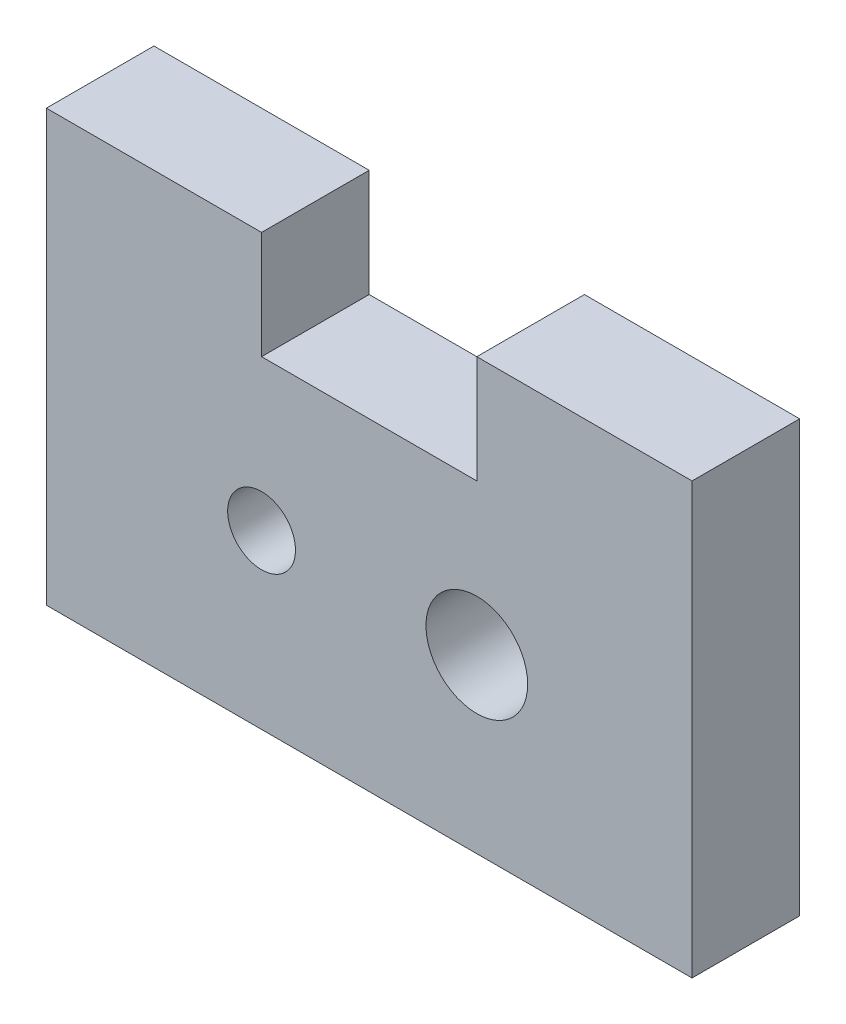
ISO-10303-21;
HEADER;
FILE_DESCRIPTION(('STEP AP214'),'2;1');
FILE_NAME('part.step','',(''),(''),'','','');
FILE_SCHEMA(('AUTOMOTIVE_DESIGN { 1 0 10303 214 1 1 1 1 }'));
ENDSEC;
DATA;
#1=APPLICATION_CONTEXT('core data for automotive mechanical design processes');
#2=APPLICATION_PROTOCOL_DEFINITION('international standard','automotive_design',2000,#1);
#3=PRODUCT_CONTEXT('',#1,'mechanical');
#4=PRODUCT('Part','Part','',(#3));
#5=PRODUCT_RELATED_PRODUCT_CATEGORY('part','',(#4));
#6=PRODUCT_DEFINITION_FORMATION('','',#4);
#7=PRODUCT_DEFINITION_CONTEXT('part definition',#1,'design');
#8=PRODUCT_DEFINITION('design','',#6,#7);
#9=PRODUCT_DEFINITION_SHAPE('','',#8);
#10=(LENGTH_UNIT() NAMED_UNIT(*) SI_UNIT(.MILLI.,.METRE.));
#11=(NAMED_UNIT(*) PLANE_ANGLE_UNIT() SI_UNIT($,.RADIAN.));
#12=(NAMED_UNIT(*) SI_UNIT($,.STERADIAN.) SOLID_ANGLE_UNIT());
#13=UNCERTAINTY_MEASURE_WITH_UNIT(LENGTH_MEASURE(1.E-05),#10,'distance_accuracy_value','');
#14=(GEOMETRIC_REPRESENTATION_CONTEXT(3) GLOBAL_UNCERTAINTY_ASSIGNED_CONTEXT((#13)) GLOBAL_UNIT_ASSIGNED_CONTEXT((#10,
#11,#12)) REPRESENTATION_CONTEXT('',''));
#15=CARTESIAN_POINT('',(0.,0.,0.));
#16=DIRECTION('',(0.,0.,1.));
#17=DIRECTION('',(1.,0.,0.));
#18=AXIS2_PLACEMENT_3D('',#15,#16,#17);
#19=CARTESIAN_POINT('',(0.,0.,3.175));
#20=DIRECTION('',(0.,0.,-1.));
#21=DIRECTION('',(-1.,0.,0.));
#22=AXIS2_PLACEMENT_3D('',#19,#20,#21);
#23=PLANE('',#22);
#24=CARTESIAN_POINT('',(12.7,5.08,3.175));
#25=DIRECTION('',(0.,0.,1.));
#26=DIRECTION('',(1.,0.,0.));
#27=AXIS2_PLACEMENT_3D('',#24,#25,#26);
#28=CIRCLE('',#27,1.5);
#29=CARTESIAN_POINT('',(14.2,5.08,3.175));
#30=VERTEX_POINT('',#29);
#31=EDGE_CURVE('E134',#30,#30,#28,.T.);
#32=ORIENTED_EDGE('',*,*,#31,.F.);
#33=EDGE_LOOP('',(#32));
#34=FACE_BOUND('',#33,.T.);
#35=DIRECTION('',(0.,-1.,0.));
#36=VECTOR('',#35,1.);
#37=CARTESIAN_POINT('',(0.,0.,3.175));
#38=LINE('',#37,#36);
#39=CARTESIAN_POINT('',(0.,12.7,3.175));
#40=VERTEX_POINT('',#39);
#41=CARTESIAN_POINT('',(0.,0.,3.175));
#42=VERTEX_POINT('',#41);
#43=EDGE_CURVE('E145',#40,#42,#38,.T.);
#44=ORIENTED_EDGE('',*,*,#43,.T.);
#45=DIRECTION('',(1.,0.,0.));
#46=VECTOR('',#45,1.);
#47=CARTESIAN_POINT('',(0.,0.,3.175));
#48=LINE('',#47,#46);
#49=CARTESIAN_POINT('',(19.05,0.,3.175));
#50=VERTEX_POINT('',#49);
#51=EDGE_CURVE('E93',#42,#50,#48,.T.);
#52=ORIENTED_EDGE('',*,*,#51,.T.);
#53=DIRECTION('',(0.,1.,0.));
#54=VECTOR('',#53,1.);
#55=CARTESIAN_POINT('',(19.05,0.,3.175));
#56=LINE('',#55,#54);
#57=CARTESIAN_POINT('',(19.05,12.7,3.175));
#58=VERTEX_POINT('',#57);
#59=EDGE_CURVE('E160',#50,#58,#56,.T.);
#60=ORIENTED_EDGE('',*,*,#59,.T.);
#61=DIRECTION('',(-1.,0.,0.));
#62=VECTOR('',#61,1.);
#63=CARTESIAN_POINT('',(12.7,12.7,3.175));
#64=LINE('',#63,#62);
#65=CARTESIAN_POINT('',(12.7,12.7,3.175));
#66=VERTEX_POINT('',#65);
#67=EDGE_CURVE('E173',#58,#66,#64,.T.);
#68=ORIENTED_EDGE('',*,*,#67,.T.);
#69=DIRECTION('',(0.,-1.,0.));
#70=VECTOR('',#69,1.);
#71=CARTESIAN_POINT('',(12.7,9.52500000000001,3.175));
#72=LINE('',#71,#70);
#73=CARTESIAN_POINT('',(12.7,9.52500000000001,3.175));
#74=VERTEX_POINT('',#73);
#75=EDGE_CURVE('E112',#66,#74,#72,.T.);
#76=ORIENTED_EDGE('',*,*,#75,.T.);
#77=DIRECTION('',(-1.,0.,0.));
#78=VECTOR('',#77,1.);
#79=CARTESIAN_POINT('',(6.35,9.52500000000001,3.175));
#80=LINE('',#79,#78);
#81=CARTESIAN_POINT('',(6.35,9.52500000000001,3.175));
#82=VERTEX_POINT('',#81);
#83=EDGE_CURVE('E106',#74,#82,#80,.T.);
#84=ORIENTED_EDGE('',*,*,#83,.T.);
#85=DIRECTION('',(0.,1.,0.));
#86=VECTOR('',#85,1.);
#87=CARTESIAN_POINT('',(6.35,12.7,3.175));
#88=LINE('',#87,#86);
#89=CARTESIAN_POINT('',(6.35,12.7,3.175));
#90=VERTEX_POINT('',#89);
#91=EDGE_CURVE('E110',#82,#90,#88,.T.);
#92=ORIENTED_EDGE('',*,*,#91,.T.);
#93=DIRECTION('',(-1.,0.,0.));
#94=VECTOR('',#93,1.);
#95=CARTESIAN_POINT('',(0.,12.7,3.175));
#96=LINE('',#95,#94);
#97=EDGE_CURVE('E50',#90,#40,#96,.T.);
#98=ORIENTED_EDGE('',*,*,#97,.T.);
#99=EDGE_LOOP('',(#44,#52,#60,#68,#76,#84,#92,#98));
#100=FACE_BOUND('',#99,.T.);
#101=CARTESIAN_POINT('',(6.35,5.08,3.175));
#102=DIRECTION('',(0.,0.,1.));
#103=DIRECTION('',(1.,0.,0.));
#104=AXIS2_PLACEMENT_3D('',#101,#102,#103);
#105=CIRCLE('',#104,1.);
#106=CARTESIAN_POINT('',(7.35,5.08,3.175));
#107=VERTEX_POINT('',#106);
#108=EDGE_CURVE('E182',#107,#107,#105,.T.);
#109=ORIENTED_EDGE('',*,*,#108,.F.);
#110=EDGE_LOOP('',(#109));
#111=FACE_BOUND('',#110,.T.);
#112=ADVANCED_FACE('F33',(#34,#100,#111),#23,.F.);
#113=CARTESIAN_POINT('',(0.,0.,0.));
#114=DIRECTION('',(0.,0.,-1.));
#115=DIRECTION('',(-1.,0.,0.));
#116=AXIS2_PLACEMENT_3D('',#113,#114,#115);
#117=PLANE('',#116);
#118=CARTESIAN_POINT('',(12.7,5.08,0.));
#119=DIRECTION('',(0.,0.,1.));
#120=DIRECTION('',(1.,0.,0.));
#121=AXIS2_PLACEMENT_3D('',#118,#119,#120);
#122=CIRCLE('',#121,1.5);
#123=CARTESIAN_POINT('',(14.2,5.08,0.));
#124=VERTEX_POINT('',#123);
#125=EDGE_CURVE('E179',#124,#124,#122,.T.);
#126=ORIENTED_EDGE('',*,*,#125,.T.);
#127=EDGE_LOOP('',(#126));
#128=FACE_BOUND('',#127,.T.);
#129=DIRECTION('',(0.,-1.,0.));
#130=VECTOR('',#129,1.);
#131=CARTESIAN_POINT('',(0.,0.,0.));
#132=LINE('',#131,#130);
#133=CARTESIAN_POINT('',(0.,12.7,0.));
#134=VERTEX_POINT('',#133);
#135=CARTESIAN_POINT('',(0.,0.,0.));
#136=VERTEX_POINT('',#135);
#137=EDGE_CURVE('E130',#134,#136,#132,.T.);
#138=ORIENTED_EDGE('',*,*,#137,.F.);
#139=DIRECTION('',(-1.,0.,0.));
#140=VECTOR('',#139,1.);
#141=CARTESIAN_POINT('',(0.,12.7,0.));
#142=LINE('',#141,#140);
#143=CARTESIAN_POINT('',(6.35,12.7,0.));
#144=VERTEX_POINT('',#143);
#145=EDGE_CURVE('E85',#144,#134,#142,.T.);
#146=ORIENTED_EDGE('',*,*,#145,.F.);
#147=DIRECTION('',(0.,1.,0.));
#148=VECTOR('',#147,1.);
#149=CARTESIAN_POINT('',(6.35,12.7,0.));
#150=LINE('',#149,#148);
#151=CARTESIAN_POINT('',(6.35,9.52500000000001,0.));
#152=VERTEX_POINT('',#151);
#153=EDGE_CURVE('E79',#152,#144,#150,.T.);
#154=ORIENTED_EDGE('',*,*,#153,.F.);
#155=DIRECTION('',(-1.,0.,0.));
#156=VECTOR('',#155,1.);
#157=CARTESIAN_POINT('',(6.35,9.52500000000001,0.));
#158=LINE('',#157,#156);
#159=CARTESIAN_POINT('',(12.7,9.52500000000001,0.));
#160=VERTEX_POINT('',#159);
#161=EDGE_CURVE('E120',#160,#152,#158,.T.);
#162=ORIENTED_EDGE('',*,*,#161,.F.);
#163=DIRECTION('',(0.,-1.,0.));
#164=VECTOR('',#163,1.);
#165=CARTESIAN_POINT('',(12.7,9.52500000000001,0.));
#166=LINE('',#165,#164);
#167=CARTESIAN_POINT('',(12.7,12.7,0.));
#168=VERTEX_POINT('',#167);
#169=EDGE_CURVE('E140',#168,#160,#166,.T.);
#170=ORIENTED_EDGE('',*,*,#169,.F.);
#171=DIRECTION('',(-1.,0.,0.));
#172=VECTOR('',#171,1.);
#173=CARTESIAN_POINT('',(12.7,12.7,0.));
#174=LINE('',#173,#172);
#175=CARTESIAN_POINT('',(19.05,12.7,0.));
#176=VERTEX_POINT('',#175);
#177=EDGE_CURVE('E138',#176,#168,#174,.T.);
#178=ORIENTED_EDGE('',*,*,#177,.F.);
#179=DIRECTION('',(0.,1.,0.));
#180=VECTOR('',#179,1.);
#181=CARTESIAN_POINT('',(19.05,0.,0.));
#182=LINE('',#181,#180);
#183=CARTESIAN_POINT('',(19.05,0.,0.));
#184=VERTEX_POINT('',#183);
#185=EDGE_CURVE('E136',#184,#176,#182,.T.);
#186=ORIENTED_EDGE('',*,*,#185,.F.);
#187=DIRECTION('',(1.,0.,0.));
#188=VECTOR('',#187,1.);
#189=CARTESIAN_POINT('',(0.,0.,0.));
#190=LINE('',#189,#188);
#191=EDGE_CURVE('E133',#136,#184,#190,.T.);
#192=ORIENTED_EDGE('',*,*,#191,.F.);
#193=EDGE_LOOP('',(#138,#146,#154,#162,#170,#178,#186,#192));
#194=FACE_BOUND('',#193,.T.);
#195=CARTESIAN_POINT('',(6.35,5.08,0.));
#196=DIRECTION('',(0.,0.,1.));
#197=DIRECTION('',(1.,0.,0.));
#198=AXIS2_PLACEMENT_3D('',#195,#196,#197);
#199=CIRCLE('',#198,1.);
#200=CARTESIAN_POINT('',(7.35,5.08,0.));
#201=VERTEX_POINT('',#200);
#202=EDGE_CURVE('E185',#201,#201,#199,.T.);
#203=ORIENTED_EDGE('',*,*,#202,.T.);
#204=EDGE_LOOP('',(#203));
#205=FACE_BOUND('',#204,.T.);
#206=ADVANCED_FACE('F164',(#128,#194,#205),#117,.T.);
#207=CARTESIAN_POINT('',(0.,0.,3.175));
#208=DIRECTION('',(1.,0.,0.));
#209=DIRECTION('',(0.,1.,0.));
#210=AXIS2_PLACEMENT_3D('',#207,#208,#209);
#211=PLANE('',#210);
#212=ORIENTED_EDGE('',*,*,#137,.T.);
#213=DIRECTION('',(0.,0.,-1.));
#214=VECTOR('',#213,1.);
#215=CARTESIAN_POINT('',(0.,0.,3.175));
#216=LINE('',#215,#214);
#217=EDGE_CURVE('E11',#42,#136,#216,.T.);
#218=ORIENTED_EDGE('',*,*,#217,.F.);
#219=ORIENTED_EDGE('',*,*,#43,.F.);
#220=DIRECTION('',(0.,0.,-1.));
#221=VECTOR('',#220,1.);
#222=CARTESIAN_POINT('',(0.,12.7,3.175));
#223=LINE('',#222,#221);
#224=EDGE_CURVE('E126',#40,#134,#223,.T.);
#225=ORIENTED_EDGE('',*,*,#224,.T.);
#226=EDGE_LOOP('',(#212,#218,#219,#225));
#227=FACE_BOUND('',#226,.T.);
#228=ADVANCED_FACE('F35',(#227),#211,.F.);
#229=CARTESIAN_POINT('',(0.,0.,3.175));
#230=DIRECTION('',(0.,1.,0.));
#231=DIRECTION('',(0.,0.,1.));
#232=AXIS2_PLACEMENT_3D('',#229,#230,#231);
#233=PLANE('',#232);
#234=ORIENTED_EDGE('',*,*,#191,.T.);
#235=DIRECTION('',(0.,0.,-1.));
#236=VECTOR('',#235,1.);
#237=CARTESIAN_POINT('',(19.05,0.,3.175));
#238=LINE('',#237,#236);
#239=EDGE_CURVE('E42',#50,#184,#238,.T.);
#240=ORIENTED_EDGE('',*,*,#239,.F.);
#241=ORIENTED_EDGE('',*,*,#51,.F.);
#242=ORIENTED_EDGE('',*,*,#217,.T.);
#243=EDGE_LOOP('',(#234,#240,#241,#242));
#244=FACE_BOUND('',#243,.T.);
#245=ADVANCED_FACE('F218',(#244),#233,.F.);
#246=CARTESIAN_POINT('',(19.05,0.,3.175));
#247=DIRECTION('',(-1.,0.,0.));
#248=DIRECTION('',(0.,0.,1.));
#249=AXIS2_PLACEMENT_3D('',#246,#247,#248);
#250=PLANE('',#249);
#251=ORIENTED_EDGE('',*,*,#185,.T.);
#252=DIRECTION('',(0.,0.,-1.));
#253=VECTOR('',#252,1.);
#254=CARTESIAN_POINT('',(19.05,12.7,3.175));
#255=LINE('',#254,#253);
#256=EDGE_CURVE('E152',#58,#176,#255,.T.);
#257=ORIENTED_EDGE('',*,*,#256,.F.);
#258=ORIENTED_EDGE('',*,*,#59,.F.);
#259=ORIENTED_EDGE('',*,*,#239,.T.);
#260=EDGE_LOOP('',(#251,#257,#258,#259));
#261=FACE_BOUND('',#260,.T.);
#262=ADVANCED_FACE('F158',(#261),#250,.F.);
#263=CARTESIAN_POINT('',(12.7,12.7,3.175));
#264=DIRECTION('',(0.,-1.,0.));
#265=DIRECTION('',(0.,0.,-1.));
#266=AXIS2_PLACEMENT_3D('',#263,#264,#265);
#267=PLANE('',#266);
#268=ORIENTED_EDGE('',*,*,#177,.T.);
#269=DIRECTION('',(0.,0.,-1.));
#270=VECTOR('',#269,1.);
#271=CARTESIAN_POINT('',(12.7,12.7,3.175));
#272=LINE('',#271,#270);
#273=EDGE_CURVE('E149',#66,#168,#272,.T.);
#274=ORIENTED_EDGE('',*,*,#273,.F.);
#275=ORIENTED_EDGE('',*,*,#67,.F.);
#276=ORIENTED_EDGE('',*,*,#256,.T.);
#277=EDGE_LOOP('',(#268,#274,#275,#276));
#278=FACE_BOUND('',#277,.T.);
#279=ADVANCED_FACE('F169',(#278),#267,.F.);
#280=CARTESIAN_POINT('',(12.7,9.52500000000001,3.175));
#281=DIRECTION('',(1.,0.,0.));
#282=DIRECTION('',(0.,1.,0.));
#283=AXIS2_PLACEMENT_3D('',#280,#281,#282);
#284=PLANE('',#283);
#285=ORIENTED_EDGE('',*,*,#169,.T.);
#286=DIRECTION('',(0.,0.,-1.));
#287=VECTOR('',#286,1.);
#288=CARTESIAN_POINT('',(12.7,9.52500000000001,3.175));
#289=LINE('',#288,#287);
#290=EDGE_CURVE('E121',#74,#160,#289,.T.);
#291=ORIENTED_EDGE('',*,*,#290,.F.);
#292=ORIENTED_EDGE('',*,*,#75,.F.);
#293=ORIENTED_EDGE('',*,*,#273,.T.);
#294=EDGE_LOOP('',(#285,#291,#292,#293));
#295=FACE_BOUND('',#294,.T.);
#296=ADVANCED_FACE('F172',(#295),#284,.F.);
#297=CARTESIAN_POINT('',(6.35,9.52500000000001,3.175));
#298=DIRECTION('',(0.,-1.,0.));
#299=DIRECTION('',(0.,0.,-1.));
#300=AXIS2_PLACEMENT_3D('',#297,#298,#299);
#301=PLANE('',#300);
#302=ORIENTED_EDGE('',*,*,#161,.T.);
#303=DIRECTION('',(0.,0.,-1.));
#304=VECTOR('',#303,1.);
#305=CARTESIAN_POINT('',(6.35,9.52500000000001,3.175));
#306=LINE('',#305,#304);
#307=EDGE_CURVE('E117',#82,#152,#306,.T.);
#308=ORIENTED_EDGE('',*,*,#307,.F.);
#309=ORIENTED_EDGE('',*,*,#83,.F.);
#310=ORIENTED_EDGE('',*,*,#290,.T.);
#311=EDGE_LOOP('',(#302,#308,#309,#310));
#312=FACE_BOUND('',#311,.T.);
#313=ADVANCED_FACE('F118',(#312),#301,.F.);
#314=CARTESIAN_POINT('',(6.35,12.7,3.175));
#315=DIRECTION('',(-1.,0.,0.));
#316=DIRECTION('',(0.,-1.,0.));
#317=AXIS2_PLACEMENT_3D('',#314,#315,#316);
#318=PLANE('',#317);
#319=ORIENTED_EDGE('',*,*,#153,.T.);
#320=DIRECTION('',(0.,0.,-1.));
#321=VECTOR('',#320,1.);
#322=CARTESIAN_POINT('',(6.35,12.7,3.175));
#323=LINE('',#322,#321);
#324=EDGE_CURVE('E122',#90,#144,#323,.T.);
#325=ORIENTED_EDGE('',*,*,#324,.F.);
#326=ORIENTED_EDGE('',*,*,#91,.F.);
#327=ORIENTED_EDGE('',*,*,#307,.T.);
#328=EDGE_LOOP('',(#319,#325,#326,#327));
#329=FACE_BOUND('',#328,.T.);
#330=ADVANCED_FACE('F124',(#329),#318,.F.);
#331=CARTESIAN_POINT('',(0.,12.7,3.175));
#332=DIRECTION('',(0.,-1.,0.));
#333=DIRECTION('',(0.,0.,-1.));
#334=AXIS2_PLACEMENT_3D('',#331,#332,#333);
#335=PLANE('',#334);
#336=ORIENTED_EDGE('',*,*,#145,.T.);
#337=ORIENTED_EDGE('',*,*,#224,.F.);
#338=ORIENTED_EDGE('',*,*,#97,.F.);
#339=ORIENTED_EDGE('',*,*,#324,.T.);
#340=EDGE_LOOP('',(#336,#337,#338,#339));
#341=FACE_BOUND('',#340,.T.);
#342=ADVANCED_FACE('F206',(#341),#335,.F.);
#343=CARTESIAN_POINT('',(12.7,5.08,3.175));
#344=DIRECTION('',(0.,0.,-1.));
#345=DIRECTION('',(-1.,0.,0.));
#346=AXIS2_PLACEMENT_3D('',#343,#344,#345);
#347=CYLINDRICAL_SURFACE('',#346,1.5);
#348=ORIENTED_EDGE('',*,*,#31,.T.);
#349=EDGE_LOOP('',(#348));
#350=FACE_BOUND('',#349,.T.);
#351=ORIENTED_EDGE('',*,*,#125,.F.);
#352=EDGE_LOOP('',(#351));
#353=FACE_BOUND('',#352,.T.);
#354=ADVANCED_FACE('F203',(#350,#353),#347,.F.);
#355=CARTESIAN_POINT('',(6.35,5.08,3.175));
#356=DIRECTION('',(0.,0.,-1.));
#357=DIRECTION('',(-1.,0.,0.));
#358=AXIS2_PLACEMENT_3D('',#355,#356,#357);
#359=CYLINDRICAL_SURFACE('',#358,1.);
#360=ORIENTED_EDGE('',*,*,#108,.T.);
#361=EDGE_LOOP('',(#360));
#362=FACE_BOUND('',#361,.T.);
#363=ORIENTED_EDGE('',*,*,#202,.F.);
#364=EDGE_LOOP('',(#363));
#365=FACE_BOUND('',#364,.T.);
#366=ADVANCED_FACE('F191',(#362,#365),#359,.F.);
#367=CLOSED_SHELL('',(#112,#206,#228,#245,#262,#279,#296,#313,#330,#342,#354,#366));
#368=MANIFOLD_SOLID_BREP('B2',#367);
#369=ADVANCED_BREP_SHAPE_REPRESENTATION('',(#18,#368),#14);
#370=SHAPE_DEFINITION_REPRESENTATION(#9,#369);
ENDSEC;
END-ISO-10303-21;
